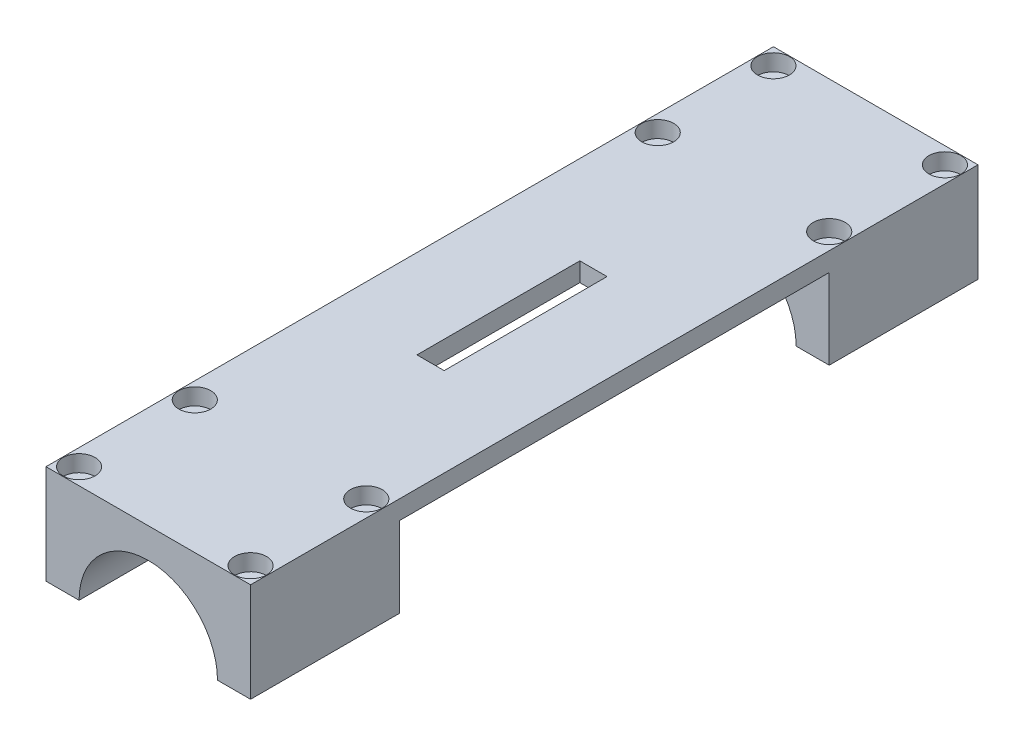
ISO-10303-21;
HEADER;
FILE_DESCRIPTION(('STEP AP214'),'2;1');
FILE_NAME('part.step','',(''),(''),'','','');
FILE_SCHEMA(('AUTOMOTIVE_DESIGN { 1 0 10303 214 1 1 1 1 }'));
ENDSEC;
DATA;
#1=APPLICATION_CONTEXT('core data for automotive mechanical design processes');
#2=APPLICATION_PROTOCOL_DEFINITION('international standard','automotive_design',2000,#1);
#3=PRODUCT_CONTEXT('',#1,'mechanical');
#4=PRODUCT('Part','Part','',(#3));
#5=PRODUCT_RELATED_PRODUCT_CATEGORY('part','',(#4));
#6=PRODUCT_DEFINITION_FORMATION('','',#4);
#7=PRODUCT_DEFINITION_CONTEXT('part definition',#1,'design');
#8=PRODUCT_DEFINITION('design','',#6,#7);
#9=PRODUCT_DEFINITION_SHAPE('','',#8);
#10=(LENGTH_UNIT() NAMED_UNIT(*) SI_UNIT(.MILLI.,.METRE.));
#11=(NAMED_UNIT(*) PLANE_ANGLE_UNIT() SI_UNIT($,.RADIAN.));
#12=(NAMED_UNIT(*) SI_UNIT($,.STERADIAN.) SOLID_ANGLE_UNIT());
#13=UNCERTAINTY_MEASURE_WITH_UNIT(LENGTH_MEASURE(1.E-05),#10,'distance_accuracy_value','');
#14=(GEOMETRIC_REPRESENTATION_CONTEXT(3) GLOBAL_UNCERTAINTY_ASSIGNED_CONTEXT((#13)) GLOBAL_UNIT_ASSIGNED_CONTEXT((#10,
#11,#12)) REPRESENTATION_CONTEXT('',''));
#15=CARTESIAN_POINT('',(0.,0.,0.));
#16=DIRECTION('',(0.,0.,1.));
#17=DIRECTION('',(1.,0.,0.));
#18=AXIS2_PLACEMENT_3D('',#15,#16,#17);
#19=CARTESIAN_POINT('',(15.5600623846513,0.,108.));
#20=DIRECTION('',(0.,1.,0.));
#21=DIRECTION('',(0.,0.,1.));
#22=AXIS2_PLACEMENT_3D('',#19,#20,#21);
#23=CYLINDRICAL_SURFACE('',#22,1.29999999999999);
#24=CARTESIAN_POINT('',(15.5600623846513,0.,108.));
#25=DIRECTION('',(0.,1.,0.));
#26=DIRECTION('',(0.,0.,1.));
#27=AXIS2_PLACEMENT_3D('',#24,#25,#26);
#28=CIRCLE('',#27,1.29999999999999);
#29=CARTESIAN_POINT('',(15.5600623846513,0.,109.3));
#30=VERTEX_POINT('',#29);
#31=EDGE_CURVE('E351',#30,#30,#28,.T.);
#32=ORIENTED_EDGE('',*,*,#31,.F.);
#33=EDGE_LOOP('',(#32));
#34=FACE_BOUND('',#33,.T.);
#35=CARTESIAN_POINT('',(15.5600623846513,15.,108.));
#36=DIRECTION('',(0.,1.,0.));
#37=DIRECTION('',(0.,0.,1.));
#38=AXIS2_PLACEMENT_3D('',#35,#36,#37);
#39=CIRCLE('',#38,1.29999999999999);
#40=CARTESIAN_POINT('',(15.5600623846513,15.,109.3));
#41=VERTEX_POINT('',#40);
#42=EDGE_CURVE('E307',#41,#41,#39,.F.);
#43=ORIENTED_EDGE('',*,*,#42,.F.);
#44=EDGE_LOOP('',(#43));
#45=FACE_BOUND('',#44,.T.);
#46=ADVANCED_FACE('F39',(#34,#45),#23,.F.);
#47=CARTESIAN_POINT('',(-15.5600623846513,0.,129.));
#48=DIRECTION('',(0.,1.,0.));
#49=DIRECTION('',(0.,0.,1.));
#50=AXIS2_PLACEMENT_3D('',#47,#48,#49);
#51=CYLINDRICAL_SURFACE('',#50,1.30000000000001);
#52=CARTESIAN_POINT('',(-15.5600623846513,0.,129.));
#53=DIRECTION('',(0.,1.,0.));
#54=DIRECTION('',(0.,0.,1.));
#55=AXIS2_PLACEMENT_3D('',#52,#53,#54);
#56=CIRCLE('',#55,1.30000000000001);
#57=CARTESIAN_POINT('',(-15.5600623846513,0.,130.3));
#58=VERTEX_POINT('',#57);
#59=EDGE_CURVE('E354',#58,#58,#56,.T.);
#60=ORIENTED_EDGE('',*,*,#59,.F.);
#61=EDGE_LOOP('',(#60));
#62=FACE_BOUND('',#61,.T.);
#63=CARTESIAN_POINT('',(-15.5600623846513,15.,129.));
#64=DIRECTION('',(0.,1.,0.));
#65=DIRECTION('',(0.,0.,1.));
#66=AXIS2_PLACEMENT_3D('',#63,#64,#65);
#67=CIRCLE('',#66,1.30000000000001);
#68=CARTESIAN_POINT('',(-15.5600623846513,15.,130.3));
#69=VERTEX_POINT('',#68);
#70=EDGE_CURVE('E303',#69,#69,#67,.F.);
#71=ORIENTED_EDGE('',*,*,#70,.F.);
#72=EDGE_LOOP('',(#71));
#73=FACE_BOUND('',#72,.T.);
#74=ADVANCED_FACE('F402',(#62,#73),#51,.F.);
#75=CARTESIAN_POINT('',(-15.5600623846513,0.,24.));
#76=DIRECTION('',(0.,1.,0.));
#77=DIRECTION('',(0.,0.,1.));
#78=AXIS2_PLACEMENT_3D('',#75,#76,#77);
#79=CYLINDRICAL_SURFACE('',#78,1.3);
#80=CARTESIAN_POINT('',(-15.5600623846513,0.,24.));
#81=DIRECTION('',(0.,1.,0.));
#82=DIRECTION('',(0.,0.,1.));
#83=AXIS2_PLACEMENT_3D('',#80,#81,#82);
#84=CIRCLE('',#83,1.3);
#85=CARTESIAN_POINT('',(-15.5600623846513,0.,25.3));
#86=VERTEX_POINT('',#85);
#87=EDGE_CURVE('E360',#86,#86,#84,.T.);
#88=ORIENTED_EDGE('',*,*,#87,.F.);
#89=EDGE_LOOP('',(#88));
#90=FACE_BOUND('',#89,.T.);
#91=CARTESIAN_POINT('',(-15.5600623846513,15.,24.));
#92=DIRECTION('',(0.,1.,0.));
#93=DIRECTION('',(0.,0.,1.));
#94=AXIS2_PLACEMENT_3D('',#91,#92,#93);
#95=CIRCLE('',#94,1.3);
#96=CARTESIAN_POINT('',(-15.5600623846513,15.,25.3));
#97=VERTEX_POINT('',#96);
#98=EDGE_CURVE('E293',#97,#97,#95,.F.);
#99=ORIENTED_EDGE('',*,*,#98,.F.);
#100=EDGE_LOOP('',(#99));
#101=FACE_BOUND('',#100,.T.);
#102=ADVANCED_FACE('F380',(#90,#101),#79,.F.);
#103=CARTESIAN_POINT('',(15.5600623846513,0.,3.));
#104=DIRECTION('',(0.,1.,0.));
#105=DIRECTION('',(0.,0.,1.));
#106=AXIS2_PLACEMENT_3D('',#103,#104,#105);
#107=CYLINDRICAL_SURFACE('',#106,1.3);
#108=CARTESIAN_POINT('',(15.5600623846513,0.,3.));
#109=DIRECTION('',(0.,1.,0.));
#110=DIRECTION('',(0.,0.,1.));
#111=AXIS2_PLACEMENT_3D('',#108,#109,#110);
#112=CIRCLE('',#111,1.3);
#113=CARTESIAN_POINT('',(15.5600623846513,0.,4.3));
#114=VERTEX_POINT('',#113);
#115=EDGE_CURVE('E369',#114,#114,#112,.T.);
#116=ORIENTED_EDGE('',*,*,#115,.F.);
#117=EDGE_LOOP('',(#116));
#118=FACE_BOUND('',#117,.T.);
#119=CARTESIAN_POINT('',(15.5600623846513,15.,3.));
#120=DIRECTION('',(0.,1.,0.));
#121=DIRECTION('',(0.,0.,1.));
#122=AXIS2_PLACEMENT_3D('',#119,#120,#121);
#123=CIRCLE('',#122,1.3);
#124=CARTESIAN_POINT('',(15.5600623846513,15.,4.3));
#125=VERTEX_POINT('',#124);
#126=EDGE_CURVE('E278',#125,#125,#123,.F.);
#127=ORIENTED_EDGE('',*,*,#126,.F.);
#128=EDGE_LOOP('',(#127));
#129=FACE_BOUND('',#128,.T.);
#130=ADVANCED_FACE('F376',(#118,#129),#107,.F.);
#131=CARTESIAN_POINT('',(0.,0.,132.));
#132=DIRECTION('',(0.,0.,-1.));
#133=DIRECTION('',(-1.,0.,0.));
#134=AXIS2_PLACEMENT_3D('',#131,#132,#133);
#135=CYLINDRICAL_SURFACE('',#134,12.5600623846513);
#136=DIRECTION('',(0.,0.,-1.));
#137=VECTOR('',#136,1.);
#138=CARTESIAN_POINT('',(12.5600623846513,0.,132.));
#139=LINE('',#138,#137);
#140=CARTESIAN_POINT('',(12.5600623846513,0.,27.));
#141=VERTEX_POINT('',#140);
#142=CARTESIAN_POINT('',(12.5600623846513,0.,0.));
#143=VERTEX_POINT('',#142);
#144=EDGE_CURVE('E272',#141,#143,#139,.T.);
#145=ORIENTED_EDGE('',*,*,#144,.F.);
#146=CARTESIAN_POINT('',(0.,0.,27.));
#147=DIRECTION('',(0.,0.,-1.));
#148=DIRECTION('',(-1.,0.,0.));
#149=AXIS2_PLACEMENT_3D('',#146,#147,#148);
#150=CIRCLE('',#149,12.5600623846513);
#151=CARTESIAN_POINT('',(-12.5600623846513,0.,27.));
#152=VERTEX_POINT('',#151);
#153=EDGE_CURVE('E218',#141,#152,#150,.F.);
#154=ORIENTED_EDGE('',*,*,#153,.T.);
#155=DIRECTION('',(0.,0.,-1.));
#156=VECTOR('',#155,1.);
#157=CARTESIAN_POINT('',(-12.5600623846513,0.,132.));
#158=LINE('',#157,#156);
#159=CARTESIAN_POINT('',(-12.5600623846513,0.,0.));
#160=VERTEX_POINT('',#159);
#161=EDGE_CURVE('E240',#152,#160,#158,.T.);
#162=ORIENTED_EDGE('',*,*,#161,.T.);
#163=CARTESIAN_POINT('',(0.,0.,0.));
#164=DIRECTION('',(0.,0.,-1.));
#165=DIRECTION('',(-1.,0.,0.));
#166=AXIS2_PLACEMENT_3D('',#163,#164,#165);
#167=CIRCLE('',#166,12.5600623846513);
#168=EDGE_CURVE('E225',#160,#143,#167,.T.);
#169=ORIENTED_EDGE('',*,*,#168,.T.);
#170=EDGE_LOOP('',(#145,#154,#162,#169));
#171=FACE_BOUND('',#170,.T.);
#172=ADVANCED_FACE('F379',(#171),#135,.F.);
#173=CARTESIAN_POINT('',(12.5600623846513,0.,132.));
#174=DIRECTION('',(0.,1.,0.));
#175=DIRECTION('',(-1.,0.,0.));
#176=AXIS2_PLACEMENT_3D('',#173,#174,#175);
#177=PLANE('',#176);
#178=CARTESIAN_POINT('',(15.5600623846513,0.,24.));
#179=DIRECTION('',(0.,1.,0.));
#180=DIRECTION('',(0.,0.,-1.));
#181=AXIS2_PLACEMENT_3D('',#178,#179,#180);
#182=CIRCLE('',#181,1.3);
#183=CARTESIAN_POINT('',(15.5600623846513,0.,22.7));
#184=VERTEX_POINT('',#183);
#185=EDGE_CURVE('E366',#184,#184,#182,.T.);
#186=ORIENTED_EDGE('',*,*,#185,.T.);
#187=EDGE_LOOP('',(#186));
#188=FACE_BOUND('',#187,.T.);
#189=ORIENTED_EDGE('',*,*,#115,.T.);
#190=EDGE_LOOP('',(#189));
#191=FACE_BOUND('',#190,.T.);
#192=DIRECTION('',(0.,0.,-1.));
#193=VECTOR('',#192,1.);
#194=CARTESIAN_POINT('',(18.5600623846513,0.,132.));
#195=LINE('',#194,#193);
#196=CARTESIAN_POINT('',(18.5600623846513,0.,27.));
#197=VERTEX_POINT('',#196);
#198=CARTESIAN_POINT('',(18.5600623846513,0.,0.));
#199=VERTEX_POINT('',#198);
#200=EDGE_CURVE('E268',#197,#199,#195,.T.);
#201=ORIENTED_EDGE('',*,*,#200,.F.);
#202=DIRECTION('',(-1.,0.,0.));
#203=VECTOR('',#202,1.);
#204=CARTESIAN_POINT('',(113.439937615349,0.,27.));
#205=LINE('',#204,#203);
#206=EDGE_CURVE('E200',#197,#141,#205,.T.);
#207=ORIENTED_EDGE('',*,*,#206,.T.);
#208=ORIENTED_EDGE('',*,*,#144,.T.);
#209=DIRECTION('',(1.,0.,0.));
#210=VECTOR('',#209,1.);
#211=CARTESIAN_POINT('',(12.5600623846513,0.,0.));
#212=LINE('',#211,#210);
#213=EDGE_CURVE('E243',#143,#199,#212,.T.);
#214=ORIENTED_EDGE('',*,*,#213,.T.);
#215=EDGE_LOOP('',(#201,#207,#208,#214));
#216=FACE_BOUND('',#215,.T.);
#217=ADVANCED_FACE('F373',(#188,#191,#216),#177,.F.);
#218=CARTESIAN_POINT('',(-12.5600623846513,0.,132.));
#219=DIRECTION('',(0.,1.,0.));
#220=DIRECTION('',(-1.,0.,0.));
#221=AXIS2_PLACEMENT_3D('',#218,#219,#220);
#222=PLANE('',#221);
#223=ORIENTED_EDGE('',*,*,#87,.T.);
#224=EDGE_LOOP('',(#223));
#225=FACE_BOUND('',#224,.T.);
#226=CARTESIAN_POINT('',(-15.5600623846513,0.,3.));
#227=DIRECTION('',(0.,1.,0.));
#228=DIRECTION('',(0.,0.,-1.));
#229=AXIS2_PLACEMENT_3D('',#226,#227,#228);
#230=CIRCLE('',#229,1.3);
#231=CARTESIAN_POINT('',(-15.5600623846513,0.,1.7));
#232=VERTEX_POINT('',#231);
#233=EDGE_CURVE('E363',#232,#232,#230,.T.);
#234=ORIENTED_EDGE('',*,*,#233,.T.);
#235=EDGE_LOOP('',(#234));
#236=FACE_BOUND('',#235,.T.);
#237=ORIENTED_EDGE('',*,*,#161,.F.);
#238=DIRECTION('',(-1.,0.,0.));
#239=VECTOR('',#238,1.);
#240=CARTESIAN_POINT('',(-12.5600623846513,0.,27.));
#241=LINE('',#240,#239);
#242=CARTESIAN_POINT('',(-18.5600623846513,0.,27.));
#243=VERTEX_POINT('',#242);
#244=EDGE_CURVE('E11',#152,#243,#241,.T.);
#245=ORIENTED_EDGE('',*,*,#244,.T.);
#246=DIRECTION('',(0.,0.,-1.));
#247=VECTOR('',#246,1.);
#248=CARTESIAN_POINT('',(-18.5600623846513,0.,132.));
#249=LINE('',#248,#247);
#250=CARTESIAN_POINT('',(-18.5600623846513,0.,0.));
#251=VERTEX_POINT('',#250);
#252=EDGE_CURVE('E258',#243,#251,#249,.T.);
#253=ORIENTED_EDGE('',*,*,#252,.T.);
#254=DIRECTION('',(1.,0.,0.));
#255=VECTOR('',#254,1.);
#256=CARTESIAN_POINT('',(-12.5600623846513,0.,0.));
#257=LINE('',#256,#255);
#258=EDGE_CURVE('E230',#251,#160,#257,.T.);
#259=ORIENTED_EDGE('',*,*,#258,.T.);
#260=EDGE_LOOP('',(#237,#245,#253,#259));
#261=FACE_BOUND('',#260,.T.);
#262=ADVANCED_FACE('F461',(#225,#236,#261),#222,.F.);
#263=CARTESIAN_POINT('',(-12.5600623846513,0.,132.));
#264=VERTEX_POINT('',#263);
#265=CARTESIAN_POINT('',(-12.5600623846513,0.,105.));
#266=VERTEX_POINT('',#265);
#267=EDGE_CURVE('E255',#264,#266,#158,.T.);
#268=ORIENTED_EDGE('',*,*,#267,.T.);
#269=CARTESIAN_POINT('',(0.,0.,105.));
#270=DIRECTION('',(0.,0.,1.));
#271=DIRECTION('',(1.,0.,0.));
#272=AXIS2_PLACEMENT_3D('',#269,#270,#271);
#273=CIRCLE('',#272,12.5600623846513);
#274=CARTESIAN_POINT('',(12.5600623846513,0.,105.));
#275=VERTEX_POINT('',#274);
#276=EDGE_CURVE('E212',#266,#275,#273,.F.);
#277=ORIENTED_EDGE('',*,*,#276,.T.);
#278=CARTESIAN_POINT('',(12.5600623846513,0.,132.));
#279=VERTEX_POINT('',#278);
#280=EDGE_CURVE('E273',#279,#275,#139,.T.);
#281=ORIENTED_EDGE('',*,*,#280,.F.);
#282=CARTESIAN_POINT('',(0.,0.,132.));
#283=DIRECTION('',(0.,0.,-1.));
#284=DIRECTION('',(-1.,0.,0.));
#285=AXIS2_PLACEMENT_3D('',#282,#283,#284);
#286=CIRCLE('',#285,12.5600623846513);
#287=EDGE_CURVE('E226',#264,#279,#286,.T.);
#288=ORIENTED_EDGE('',*,*,#287,.F.);
#289=EDGE_LOOP('',(#268,#277,#281,#288));
#290=FACE_BOUND('',#289,.T.);
#291=ADVANCED_FACE('F41',(#290),#135,.F.);
#292=CARTESIAN_POINT('',(15.5600623846513,0.,129.));
#293=DIRECTION('',(0.,1.,0.));
#294=DIRECTION('',(0.,0.,-1.));
#295=AXIS2_PLACEMENT_3D('',#292,#293,#294);
#296=CIRCLE('',#295,1.3);
#297=CARTESIAN_POINT('',(15.5600623846513,0.,127.7));
#298=VERTEX_POINT('',#297);
#299=EDGE_CURVE('E281',#298,#298,#296,.T.);
#300=ORIENTED_EDGE('',*,*,#299,.T.);
#301=EDGE_LOOP('',(#300));
#302=FACE_BOUND('',#301,.T.);
#303=ORIENTED_EDGE('',*,*,#31,.T.);
#304=EDGE_LOOP('',(#303));
#305=FACE_BOUND('',#304,.T.);
#306=ORIENTED_EDGE('',*,*,#280,.T.);
#307=DIRECTION('',(-1.,0.,0.));
#308=VECTOR('',#307,1.);
#309=CARTESIAN_POINT('',(113.439937615349,0.,105.));
#310=LINE('',#309,#308);
#311=CARTESIAN_POINT('',(18.5600623846513,0.,105.));
#312=VERTEX_POINT('',#311);
#313=EDGE_CURVE('E199',#312,#275,#310,.T.);
#314=ORIENTED_EDGE('',*,*,#313,.F.);
#315=CARTESIAN_POINT('',(18.5600623846513,0.,132.));
#316=VERTEX_POINT('',#315);
#317=EDGE_CURVE('E269',#316,#312,#195,.T.);
#318=ORIENTED_EDGE('',*,*,#317,.F.);
#319=DIRECTION('',(1.,0.,0.));
#320=VECTOR('',#319,1.);
#321=CARTESIAN_POINT('',(12.5600623846513,0.,132.));
#322=LINE('',#321,#320);
#323=EDGE_CURVE('E229',#279,#316,#322,.T.);
#324=ORIENTED_EDGE('',*,*,#323,.F.);
#325=EDGE_LOOP('',(#306,#314,#318,#324));
#326=FACE_BOUND('',#325,.T.);
#327=ADVANCED_FACE('F471',(#302,#305,#326),#177,.F.);
#328=CARTESIAN_POINT('',(18.5600623846513,0.,132.));
#329=DIRECTION('',(-1.,0.,0.));
#330=DIRECTION('',(0.,0.,1.));
#331=AXIS2_PLACEMENT_3D('',#328,#329,#330);
#332=PLANE('',#331);
#333=DIRECTION('',(0.,0.,-1.));
#334=VECTOR('',#333,1.);
#335=CARTESIAN_POINT('',(18.5600623846513,14.57,132.));
#336=LINE('',#335,#334);
#337=CARTESIAN_POINT('',(18.5600623846513,14.57,105.));
#338=VERTEX_POINT('',#337);
#339=CARTESIAN_POINT('',(18.5600623846513,14.57,27.));
#340=VERTEX_POINT('',#339);
#341=EDGE_CURVE('E222',#338,#340,#336,.T.);
#342=ORIENTED_EDGE('',*,*,#341,.T.);
#343=DIRECTION('',(0.,-1.,0.));
#344=VECTOR('',#343,1.);
#345=CARTESIAN_POINT('',(18.5600623846513,0.,27.));
#346=LINE('',#345,#344);
#347=EDGE_CURVE('E215',#340,#197,#346,.T.);
#348=ORIENTED_EDGE('',*,*,#347,.T.);
#349=ORIENTED_EDGE('',*,*,#200,.T.);
#350=DIRECTION('',(0.,1.,0.));
#351=VECTOR('',#350,1.);
#352=CARTESIAN_POINT('',(18.5600623846513,0.,0.));
#353=LINE('',#352,#351);
#354=CARTESIAN_POINT('',(18.5600623846513,18.,0.));
#355=VERTEX_POINT('',#354);
#356=EDGE_CURVE('E246',#199,#355,#353,.T.);
#357=ORIENTED_EDGE('',*,*,#356,.T.);
#358=DIRECTION('',(0.,0.,-1.));
#359=VECTOR('',#358,1.);
#360=CARTESIAN_POINT('',(18.5600623846513,18.,132.));
#361=LINE('',#360,#359);
#362=CARTESIAN_POINT('',(18.5600623846513,18.,132.));
#363=VERTEX_POINT('',#362);
#364=EDGE_CURVE('E265',#363,#355,#361,.T.);
#365=ORIENTED_EDGE('',*,*,#364,.F.);
#366=DIRECTION('',(0.,1.,0.));
#367=VECTOR('',#366,1.);
#368=CARTESIAN_POINT('',(18.5600623846513,0.,132.));
#369=LINE('',#368,#367);
#370=EDGE_CURVE('E232',#316,#363,#369,.T.);
#371=ORIENTED_EDGE('',*,*,#370,.F.);
#372=ORIENTED_EDGE('',*,*,#317,.T.);
#373=DIRECTION('',(0.,1.,0.));
#374=VECTOR('',#373,1.);
#375=CARTESIAN_POINT('',(18.5600623846513,0.,105.));
#376=LINE('',#375,#374);
#377=EDGE_CURVE('E203',#312,#338,#376,.T.);
#378=ORIENTED_EDGE('',*,*,#377,.T.);
#379=EDGE_LOOP('',(#342,#348,#349,#357,#365,#371,#372,#378));
#380=FACE_BOUND('',#379,.T.);
#381=ADVANCED_FACE('F468',(#380),#332,.F.);
#382=CARTESIAN_POINT('',(-18.5600623846513,18.,132.));
#383=DIRECTION('',(0.,-1.,0.));
#384=DIRECTION('',(0.,0.,-1.));
#385=AXIS2_PLACEMENT_3D('',#382,#383,#384);
#386=PLANE('',#385);
#387=CARTESIAN_POINT('',(15.5600623846513,18.,129.));
#388=DIRECTION('',(0.,1.,0.));
#389=DIRECTION('',(0.,0.,-1.));
#390=AXIS2_PLACEMENT_3D('',#387,#388,#389);
#391=CIRCLE('',#390,2.9);
#392=CARTESIAN_POINT('',(15.5600623846513,18.,126.1));
#393=VERTEX_POINT('',#392);
#394=EDGE_CURVE('E323',#393,#393,#391,.T.);
#395=ORIENTED_EDGE('',*,*,#394,.F.);
#396=EDGE_LOOP('',(#395));
#397=FACE_BOUND('',#396,.T.);
#398=CARTESIAN_POINT('',(15.5600623846513,18.,108.));
#399=DIRECTION('',(0.,1.,0.));
#400=DIRECTION('',(0.,0.,1.));
#401=AXIS2_PLACEMENT_3D('',#398,#399,#400);
#402=CIRCLE('',#401,2.9);
#403=CARTESIAN_POINT('',(15.5600623846513,18.,110.9));
#404=VERTEX_POINT('',#403);
#405=EDGE_CURVE('E316',#404,#404,#402,.T.);
#406=ORIENTED_EDGE('',*,*,#405,.F.);
#407=EDGE_LOOP('',(#406));
#408=FACE_BOUND('',#407,.T.);
#409=CARTESIAN_POINT('',(-15.5600623846513,18.,129.));
#410=DIRECTION('',(0.,1.,0.));
#411=DIRECTION('',(0.,0.,1.));
#412=AXIS2_PLACEMENT_3D('',#409,#410,#411);
#413=CIRCLE('',#412,2.9);
#414=CARTESIAN_POINT('',(-15.5600623846513,18.,131.9));
#415=VERTEX_POINT('',#414);
#416=EDGE_CURVE('E309',#415,#415,#413,.T.);
#417=ORIENTED_EDGE('',*,*,#416,.F.);
#418=EDGE_LOOP('',(#417));
#419=FACE_BOUND('',#418,.T.);
#420=CARTESIAN_POINT('',(-15.5600623846513,18.,108.));
#421=DIRECTION('',(0.,1.,0.));
#422=DIRECTION('',(0.,0.,-1.));
#423=AXIS2_PLACEMENT_3D('',#420,#421,#422);
#424=CIRCLE('',#423,2.9);
#425=CARTESIAN_POINT('',(-15.5600623846513,18.,105.1));
#426=VERTEX_POINT('',#425);
#427=EDGE_CURVE('E305',#426,#426,#424,.T.);
#428=ORIENTED_EDGE('',*,*,#427,.F.);
#429=EDGE_LOOP('',(#428));
#430=FACE_BOUND('',#429,.T.);
#431=CARTESIAN_POINT('',(-15.5600623846513,18.,24.));
#432=DIRECTION('',(0.,1.,0.));
#433=DIRECTION('',(0.,0.,1.));
#434=AXIS2_PLACEMENT_3D('',#431,#432,#433);
#435=CIRCLE('',#434,2.9);
#436=CARTESIAN_POINT('',(-15.5600623846513,18.,26.9));
#437=VERTEX_POINT('',#436);
#438=EDGE_CURVE('E301',#437,#437,#435,.T.);
#439=ORIENTED_EDGE('',*,*,#438,.F.);
#440=EDGE_LOOP('',(#439));
#441=FACE_BOUND('',#440,.T.);
#442=CARTESIAN_POINT('',(-15.5600623846513,18.,3.00000000000001));
#443=DIRECTION('',(0.,1.,0.));
#444=DIRECTION('',(0.,0.,-1.));
#445=AXIS2_PLACEMENT_3D('',#442,#443,#444);
#446=CIRCLE('',#445,2.9);
#447=CARTESIAN_POINT('',(-15.5600623846513,18.,0.100000000000006));
#448=VERTEX_POINT('',#447);
#449=EDGE_CURVE('E296',#448,#448,#446,.T.);
#450=ORIENTED_EDGE('',*,*,#449,.F.);
#451=EDGE_LOOP('',(#450));
#452=FACE_BOUND('',#451,.T.);
#453=CARTESIAN_POINT('',(15.5600623846513,18.,24.));
#454=DIRECTION('',(0.,1.,0.));
#455=DIRECTION('',(0.,0.,-1.));
#456=AXIS2_PLACEMENT_3D('',#453,#454,#455);
#457=CIRCLE('',#456,2.9);
#458=CARTESIAN_POINT('',(15.5600623846513,18.,21.1));
#459=VERTEX_POINT('',#458);
#460=EDGE_CURVE('E291',#459,#459,#457,.T.);
#461=ORIENTED_EDGE('',*,*,#460,.F.);
#462=EDGE_LOOP('',(#461));
#463=FACE_BOUND('',#462,.T.);
#464=CARTESIAN_POINT('',(15.5600623846513,18.,3.));
#465=DIRECTION('',(0.,1.,0.));
#466=DIRECTION('',(0.,0.,1.));
#467=AXIS2_PLACEMENT_3D('',#464,#465,#466);
#468=CIRCLE('',#467,2.9);
#469=CARTESIAN_POINT('',(15.5600623846513,18.,5.9));
#470=VERTEX_POINT('',#469);
#471=EDGE_CURVE('E286',#470,#470,#468,.T.);
#472=ORIENTED_EDGE('',*,*,#471,.F.);
#473=EDGE_LOOP('',(#472));
#474=FACE_BOUND('',#473,.T.);
#475=DIRECTION('',(-1.,0.,0.));
#476=VECTOR('',#475,1.);
#477=CARTESIAN_POINT('',(-18.5600623846513,18.,80.778146300668));
#478=LINE('',#477,#476);
#479=CARTESIAN_POINT('',(2.47006065999988,18.,80.778146300668));
#480=VERTEX_POINT('',#479);
#481=CARTESIAN_POINT('',(-2.47006065999988,18.,80.778146300668));
#482=VERTEX_POINT('',#481);
#483=EDGE_CURVE('E185',#480,#482,#478,.T.);
#484=ORIENTED_EDGE('',*,*,#483,.T.);
#485=DIRECTION('',(0.,0.,-1.));
#486=VECTOR('',#485,1.);
#487=CARTESIAN_POINT('',(-2.47006065999988,18.,132.));
#488=LINE('',#487,#486);
#489=CARTESIAN_POINT('',(-2.47006065999988,18.,51.221853699332));
#490=VERTEX_POINT('',#489);
#491=EDGE_CURVE('E188',#482,#490,#488,.T.);
#492=ORIENTED_EDGE('',*,*,#491,.T.);
#493=DIRECTION('',(1.,0.,0.));
#494=VECTOR('',#493,1.);
#495=CARTESIAN_POINT('',(-18.5600623846513,18.,51.221853699332));
#496=LINE('',#495,#494);
#497=CARTESIAN_POINT('',(2.47006065999988,18.,51.221853699332));
#498=VERTEX_POINT('',#497);
#499=EDGE_CURVE('E180',#490,#498,#496,.T.);
#500=ORIENTED_EDGE('',*,*,#499,.T.);
#501=DIRECTION('',(0.,0.,1.));
#502=VECTOR('',#501,1.);
#503=CARTESIAN_POINT('',(2.47006065999988,18.,132.));
#504=LINE('',#503,#502);
#505=EDGE_CURVE('E160',#498,#480,#504,.T.);
#506=ORIENTED_EDGE('',*,*,#505,.T.);
#507=EDGE_LOOP('',(#484,#492,#500,#506));
#508=FACE_BOUND('',#507,.T.);
#509=DIRECTION('',(-1.,0.,0.));
#510=VECTOR('',#509,1.);
#511=CARTESIAN_POINT('',(-18.5600623846513,18.,0.));
#512=LINE('',#511,#510);
#513=CARTESIAN_POINT('',(-18.5600623846513,18.,0.));
#514=VERTEX_POINT('',#513);
#515=EDGE_CURVE('E248',#355,#514,#512,.T.);
#516=ORIENTED_EDGE('',*,*,#515,.T.);
#517=DIRECTION('',(0.,0.,-1.));
#518=VECTOR('',#517,1.);
#519=CARTESIAN_POINT('',(-18.5600623846513,18.,132.));
#520=LINE('',#519,#518);
#521=CARTESIAN_POINT('',(-18.5600623846513,18.,132.));
#522=VERTEX_POINT('',#521);
#523=EDGE_CURVE('E262',#522,#514,#520,.T.);
#524=ORIENTED_EDGE('',*,*,#523,.F.);
#525=DIRECTION('',(-1.,0.,0.));
#526=VECTOR('',#525,1.);
#527=CARTESIAN_POINT('',(-18.5600623846513,18.,132.));
#528=LINE('',#527,#526);
#529=EDGE_CURVE('E234',#363,#522,#528,.T.);
#530=ORIENTED_EDGE('',*,*,#529,.F.);
#531=ORIENTED_EDGE('',*,*,#364,.T.);
#532=EDGE_LOOP('',(#516,#524,#530,#531));
#533=FACE_BOUND('',#532,.T.);
#534=ADVANCED_FACE('F464',(#397,#408,#419,#430,#441,#452,#463,#474,#508,#533),#386,.F.);
#535=CARTESIAN_POINT('',(-18.5600623846513,0.,132.));
#536=DIRECTION('',(1.,0.,0.));
#537=DIRECTION('',(0.,0.,-1.));
#538=AXIS2_PLACEMENT_3D('',#535,#536,#537);
#539=PLANE('',#538);
#540=ORIENTED_EDGE('',*,*,#252,.F.);
#541=DIRECTION('',(0.,-1.,0.));
#542=VECTOR('',#541,1.);
#543=CARTESIAN_POINT('',(-18.5600623846513,0.,27.));
#544=LINE('',#543,#542);
#545=CARTESIAN_POINT('',(-18.5600623846513,14.57,27.));
#546=VERTEX_POINT('',#545);
#547=EDGE_CURVE('E197',#546,#243,#544,.T.);
#548=ORIENTED_EDGE('',*,*,#547,.F.);
#549=DIRECTION('',(0.,0.,-1.));
#550=VECTOR('',#549,1.);
#551=CARTESIAN_POINT('',(-18.5600623846513,14.57,105.));
#552=LINE('',#551,#550);
#553=CARTESIAN_POINT('',(-18.5600623846513,14.57,105.));
#554=VERTEX_POINT('',#553);
#555=EDGE_CURVE('E194',#554,#546,#552,.T.);
#556=ORIENTED_EDGE('',*,*,#555,.F.);
#557=DIRECTION('',(0.,1.,0.));
#558=VECTOR('',#557,1.);
#559=CARTESIAN_POINT('',(-18.5600623846513,0.,105.));
#560=LINE('',#559,#558);
#561=CARTESIAN_POINT('',(-18.5600623846513,0.,105.));
#562=VERTEX_POINT('',#561);
#563=EDGE_CURVE('E191',#562,#554,#560,.T.);
#564=ORIENTED_EDGE('',*,*,#563,.F.);
#565=CARTESIAN_POINT('',(-18.5600623846513,0.,132.));
#566=VERTEX_POINT('',#565);
#567=EDGE_CURVE('E259',#566,#562,#249,.T.);
#568=ORIENTED_EDGE('',*,*,#567,.F.);
#569=DIRECTION('',(0.,-1.,0.));
#570=VECTOR('',#569,1.);
#571=CARTESIAN_POINT('',(-18.5600623846513,0.,132.));
#572=LINE('',#571,#570);
#573=EDGE_CURVE('E236',#522,#566,#572,.T.);
#574=ORIENTED_EDGE('',*,*,#573,.F.);
#575=ORIENTED_EDGE('',*,*,#523,.T.);
#576=DIRECTION('',(0.,-1.,0.));
#577=VECTOR('',#576,1.);
#578=CARTESIAN_POINT('',(-18.5600623846513,0.,0.));
#579=LINE('',#578,#577);
#580=EDGE_CURVE('E250',#514,#251,#579,.T.);
#581=ORIENTED_EDGE('',*,*,#580,.T.);
#582=EDGE_LOOP('',(#540,#548,#556,#564,#568,#574,#575,#581));
#583=FACE_BOUND('',#582,.T.);
#584=ADVANCED_FACE('F459',(#583),#539,.F.);
#585=ORIENTED_EDGE('',*,*,#59,.T.);
#586=EDGE_LOOP('',(#585));
#587=FACE_BOUND('',#586,.T.);
#588=CARTESIAN_POINT('',(-15.5600623846513,0.,108.));
#589=DIRECTION('',(0.,1.,0.));
#590=DIRECTION('',(0.,0.,-1.));
#591=AXIS2_PLACEMENT_3D('',#588,#589,#590);
#592=CIRCLE('',#591,1.3);
#593=CARTESIAN_POINT('',(-15.5600623846513,0.,106.7));
#594=VERTEX_POINT('',#593);
#595=EDGE_CURVE('E357',#594,#594,#592,.T.);
#596=ORIENTED_EDGE('',*,*,#595,.T.);
#597=EDGE_LOOP('',(#596));
#598=FACE_BOUND('',#597,.T.);
#599=ORIENTED_EDGE('',*,*,#567,.T.);
#600=DIRECTION('',(1.,0.,0.));
#601=VECTOR('',#600,1.);
#602=CARTESIAN_POINT('',(-12.5600623846513,0.,105.));
#603=LINE('',#602,#601);
#604=EDGE_CURVE('E48',#562,#266,#603,.T.);
#605=ORIENTED_EDGE('',*,*,#604,.T.);
#606=ORIENTED_EDGE('',*,*,#267,.F.);
#607=DIRECTION('',(1.,0.,0.));
#608=VECTOR('',#607,1.);
#609=CARTESIAN_POINT('',(-12.5600623846513,0.,132.));
#610=LINE('',#609,#608);
#611=EDGE_CURVE('E238',#566,#264,#610,.T.);
#612=ORIENTED_EDGE('',*,*,#611,.F.);
#613=EDGE_LOOP('',(#599,#605,#606,#612));
#614=FACE_BOUND('',#613,.T.);
#615=ADVANCED_FACE('F452',(#587,#598,#614),#222,.F.);
#616=CARTESIAN_POINT('',(0.,0.,132.));
#617=DIRECTION('',(0.,0.,-1.));
#618=DIRECTION('',(-1.,0.,0.));
#619=AXIS2_PLACEMENT_3D('',#616,#617,#618);
#620=PLANE('',#619);
#621=ORIENTED_EDGE('',*,*,#287,.T.);
#622=ORIENTED_EDGE('',*,*,#323,.T.);
#623=ORIENTED_EDGE('',*,*,#370,.T.);
#624=ORIENTED_EDGE('',*,*,#529,.T.);
#625=ORIENTED_EDGE('',*,*,#573,.T.);
#626=ORIENTED_EDGE('',*,*,#611,.T.);
#627=EDGE_LOOP('',(#621,#622,#623,#624,#625,#626));
#628=FACE_BOUND('',#627,.T.);
#629=ADVANCED_FACE('F449',(#628),#620,.F.);
#630=CARTESIAN_POINT('',(0.,0.,0.));
#631=DIRECTION('',(0.,0.,-1.));
#632=DIRECTION('',(-1.,0.,0.));
#633=AXIS2_PLACEMENT_3D('',#630,#631,#632);
#634=PLANE('',#633);
#635=ORIENTED_EDGE('',*,*,#168,.F.);
#636=ORIENTED_EDGE('',*,*,#258,.F.);
#637=ORIENTED_EDGE('',*,*,#580,.F.);
#638=ORIENTED_EDGE('',*,*,#515,.F.);
#639=ORIENTED_EDGE('',*,*,#356,.F.);
#640=ORIENTED_EDGE('',*,*,#213,.F.);
#641=EDGE_LOOP('',(#635,#636,#637,#638,#639,#640));
#642=FACE_BOUND('',#641,.T.);
#643=ADVANCED_FACE('F445',(#642),#634,.T.);
#644=CARTESIAN_POINT('',(113.439937615349,14.57,105.));
#645=DIRECTION('',(0.,1.,0.));
#646=DIRECTION('',(0.,0.,1.));
#647=AXIS2_PLACEMENT_3D('',#644,#645,#646);
#648=PLANE('',#647);
#649=DIRECTION('',(1.,0.,0.));
#650=VECTOR('',#649,1.);
#651=CARTESIAN_POINT('',(2.47006065999988,14.57,51.221853699332));
#652=LINE('',#651,#650);
#653=CARTESIAN_POINT('',(-2.47006065999988,14.57,51.221853699332));
#654=VERTEX_POINT('',#653);
#655=CARTESIAN_POINT('',(2.47006065999988,14.57,51.221853699332));
#656=VERTEX_POINT('',#655);
#657=EDGE_CURVE('E166',#654,#656,#652,.T.);
#658=ORIENTED_EDGE('',*,*,#657,.F.);
#659=DIRECTION('',(0.,0.,-1.));
#660=VECTOR('',#659,1.);
#661=CARTESIAN_POINT('',(-2.47006065999988,14.57,51.221853699332));
#662=LINE('',#661,#660);
#663=CARTESIAN_POINT('',(-2.47006065999988,14.57,80.778146300668));
#664=VERTEX_POINT('',#663);
#665=EDGE_CURVE('E64',#664,#654,#662,.T.);
#666=ORIENTED_EDGE('',*,*,#665,.F.);
#667=DIRECTION('',(-1.,0.,0.));
#668=VECTOR('',#667,1.);
#669=CARTESIAN_POINT('',(2.47006065999988,14.57,80.778146300668));
#670=LINE('',#669,#668);
#671=CARTESIAN_POINT('',(2.47006065999988,14.57,80.778146300668));
#672=VERTEX_POINT('',#671);
#673=EDGE_CURVE('E173',#672,#664,#670,.T.);
#674=ORIENTED_EDGE('',*,*,#673,.F.);
#675=DIRECTION('',(0.,0.,1.));
#676=VECTOR('',#675,1.);
#677=CARTESIAN_POINT('',(2.47006065999988,14.57,51.221853699332));
#678=LINE('',#677,#676);
#679=EDGE_CURVE('E157',#656,#672,#678,.T.);
#680=ORIENTED_EDGE('',*,*,#679,.F.);
#681=EDGE_LOOP('',(#658,#666,#674,#680));
#682=FACE_BOUND('',#681,.T.);
#683=DIRECTION('',(-1.,0.,0.));
#684=VECTOR('',#683,1.);
#685=CARTESIAN_POINT('',(113.439937615349,14.57,105.));
#686=LINE('',#685,#684);
#687=EDGE_CURVE('E207',#338,#554,#686,.T.);
#688=ORIENTED_EDGE('',*,*,#687,.T.);
#689=ORIENTED_EDGE('',*,*,#555,.T.);
#690=DIRECTION('',(-1.,0.,0.));
#691=VECTOR('',#690,1.);
#692=CARTESIAN_POINT('',(113.439937615349,14.57,27.));
#693=LINE('',#692,#691);
#694=EDGE_CURVE('E204',#340,#546,#693,.T.);
#695=ORIENTED_EDGE('',*,*,#694,.F.);
#696=ORIENTED_EDGE('',*,*,#341,.F.);
#697=EDGE_LOOP('',(#688,#689,#695,#696));
#698=FACE_BOUND('',#697,.T.);
#699=ADVANCED_FACE('F170',(#682,#698),#648,.F.);
#700=CARTESIAN_POINT('',(113.439937615349,0.,27.));
#701=DIRECTION('',(0.,0.,-1.));
#702=DIRECTION('',(-1.,0.,0.));
#703=AXIS2_PLACEMENT_3D('',#700,#701,#702);
#704=PLANE('',#703);
#705=ORIENTED_EDGE('',*,*,#206,.F.);
#706=ORIENTED_EDGE('',*,*,#347,.F.);
#707=ORIENTED_EDGE('',*,*,#694,.T.);
#708=ORIENTED_EDGE('',*,*,#547,.T.);
#709=ORIENTED_EDGE('',*,*,#244,.F.);
#710=ORIENTED_EDGE('',*,*,#153,.F.);
#711=EDGE_LOOP('',(#705,#706,#707,#708,#709,#710));
#712=FACE_BOUND('',#711,.T.);
#713=ADVANCED_FACE('F439',(#712),#704,.F.);
#714=CARTESIAN_POINT('',(113.439937615349,0.,105.));
#715=DIRECTION('',(0.,0.,1.));
#716=DIRECTION('',(1.,0.,0.));
#717=AXIS2_PLACEMENT_3D('',#714,#715,#716);
#718=PLANE('',#717);
#719=ORIENTED_EDGE('',*,*,#604,.F.);
#720=ORIENTED_EDGE('',*,*,#563,.T.);
#721=ORIENTED_EDGE('',*,*,#687,.F.);
#722=ORIENTED_EDGE('',*,*,#377,.F.);
#723=ORIENTED_EDGE('',*,*,#313,.T.);
#724=ORIENTED_EDGE('',*,*,#276,.F.);
#725=EDGE_LOOP('',(#719,#720,#721,#722,#723,#724));
#726=FACE_BOUND('',#725,.T.);
#727=ADVANCED_FACE('F438',(#726),#718,.F.);
#728=CARTESIAN_POINT('',(-2.47006065999988,18.57,51.221853699332));
#729=DIRECTION('',(-1.,0.,0.));
#730=DIRECTION('',(0.,0.,1.));
#731=AXIS2_PLACEMENT_3D('',#728,#729,#730);
#732=PLANE('',#731);
#733=DIRECTION('',(0.,-1.,0.));
#734=VECTOR('',#733,1.);
#735=CARTESIAN_POINT('',(-2.47006065999988,18.57,80.778146300668));
#736=LINE('',#735,#734);
#737=EDGE_CURVE('E178',#482,#664,#736,.T.);
#738=ORIENTED_EDGE('',*,*,#737,.T.);
#739=ORIENTED_EDGE('',*,*,#665,.T.);
#740=DIRECTION('',(0.,-1.,0.));
#741=VECTOR('',#740,1.);
#742=CARTESIAN_POINT('',(-2.47006065999988,18.57,51.221853699332));
#743=LINE('',#742,#741);
#744=EDGE_CURVE('E163',#490,#654,#743,.T.);
#745=ORIENTED_EDGE('',*,*,#744,.F.);
#746=ORIENTED_EDGE('',*,*,#491,.F.);
#747=EDGE_LOOP('',(#738,#739,#745,#746));
#748=FACE_BOUND('',#747,.T.);
#749=ADVANCED_FACE('F431',(#748),#732,.F.);
#750=CARTESIAN_POINT('',(2.47006065999988,18.57,80.778146300668));
#751=DIRECTION('',(0.,0.,1.));
#752=DIRECTION('',(0.,-1.,0.));
#753=AXIS2_PLACEMENT_3D('',#750,#751,#752);
#754=PLANE('',#753);
#755=DIRECTION('',(0.,-1.,0.));
#756=VECTOR('',#755,1.);
#757=CARTESIAN_POINT('',(2.47006065999988,18.57,80.778146300668));
#758=LINE('',#757,#756);
#759=EDGE_CURVE('E162',#480,#672,#758,.T.);
#760=ORIENTED_EDGE('',*,*,#759,.T.);
#761=ORIENTED_EDGE('',*,*,#673,.T.);
#762=ORIENTED_EDGE('',*,*,#737,.F.);
#763=ORIENTED_EDGE('',*,*,#483,.F.);
#764=EDGE_LOOP('',(#760,#761,#762,#763));
#765=FACE_BOUND('',#764,.T.);
#766=ADVANCED_FACE('F428',(#765),#754,.F.);
#767=CARTESIAN_POINT('',(2.47006065999988,18.57,51.221853699332));
#768=DIRECTION('',(1.,0.,0.));
#769=DIRECTION('',(0.,0.,-1.));
#770=AXIS2_PLACEMENT_3D('',#767,#768,#769);
#771=PLANE('',#770);
#772=DIRECTION('',(0.,-1.,0.));
#773=VECTOR('',#772,1.);
#774=CARTESIAN_POINT('',(2.47006065999988,18.57,51.221853699332));
#775=LINE('',#774,#773);
#776=EDGE_CURVE('E56',#498,#656,#775,.T.);
#777=ORIENTED_EDGE('',*,*,#776,.T.);
#778=ORIENTED_EDGE('',*,*,#679,.T.);
#779=ORIENTED_EDGE('',*,*,#759,.F.);
#780=ORIENTED_EDGE('',*,*,#505,.F.);
#781=EDGE_LOOP('',(#777,#778,#779,#780));
#782=FACE_BOUND('',#781,.T.);
#783=ADVANCED_FACE('F154',(#782),#771,.F.);
#784=CARTESIAN_POINT('',(2.47006065999988,18.57,51.221853699332));
#785=DIRECTION('',(0.,0.,-1.));
#786=DIRECTION('',(0.,1.,0.));
#787=AXIS2_PLACEMENT_3D('',#784,#785,#786);
#788=PLANE('',#787);
#789=ORIENTED_EDGE('',*,*,#744,.T.);
#790=ORIENTED_EDGE('',*,*,#657,.T.);
#791=ORIENTED_EDGE('',*,*,#776,.F.);
#792=ORIENTED_EDGE('',*,*,#499,.F.);
#793=EDGE_LOOP('',(#789,#790,#791,#792));
#794=FACE_BOUND('',#793,.T.);
#795=ADVANCED_FACE('F167',(#794),#788,.F.);
#796=CARTESIAN_POINT('',(15.5600623846513,0.,24.));
#797=DIRECTION('',(0.,1.,0.));
#798=DIRECTION('',(0.,0.,1.));
#799=AXIS2_PLACEMENT_3D('',#796,#797,#798);
#800=CYLINDRICAL_SURFACE('',#799,1.3);
#801=CARTESIAN_POINT('',(15.5600623846513,15.,24.));
#802=DIRECTION('',(0.,-1.,0.));
#803=DIRECTION('',(0.,0.,-1.));
#804=AXIS2_PLACEMENT_3D('',#801,#802,#803);
#805=CIRCLE('',#804,1.3);
#806=CARTESIAN_POINT('',(15.5600623846513,15.,22.7));
#807=VERTEX_POINT('',#806);
#808=EDGE_CURVE('E283',#807,#807,#805,.F.);
#809=ORIENTED_EDGE('',*,*,#808,.T.);
#810=EDGE_LOOP('',(#809));
#811=FACE_BOUND('',#810,.T.);
#812=ORIENTED_EDGE('',*,*,#185,.F.);
#813=EDGE_LOOP('',(#812));
#814=FACE_BOUND('',#813,.T.);
#815=ADVANCED_FACE('F423',(#811,#814),#800,.F.);
#816=CARTESIAN_POINT('',(-15.5600623846513,0.,3.));
#817=DIRECTION('',(0.,1.,0.));
#818=DIRECTION('',(0.,0.,1.));
#819=AXIS2_PLACEMENT_3D('',#816,#817,#818);
#820=CYLINDRICAL_SURFACE('',#819,1.3);
#821=CARTESIAN_POINT('',(-15.5600623846513,15.,3.));
#822=DIRECTION('',(0.,-1.,0.));
#823=DIRECTION('',(0.,0.,-1.));
#824=AXIS2_PLACEMENT_3D('',#821,#822,#823);
#825=CIRCLE('',#824,1.3);
#826=CARTESIAN_POINT('',(-15.5600623846513,15.,1.7));
#827=VERTEX_POINT('',#826);
#828=EDGE_CURVE('E288',#827,#827,#825,.F.);
#829=ORIENTED_EDGE('',*,*,#828,.T.);
#830=EDGE_LOOP('',(#829));
#831=FACE_BOUND('',#830,.T.);
#832=ORIENTED_EDGE('',*,*,#233,.F.);
#833=EDGE_LOOP('',(#832));
#834=FACE_BOUND('',#833,.T.);
#835=ADVANCED_FACE('F416',(#831,#834),#820,.F.);
#836=CARTESIAN_POINT('',(-15.5600623846513,0.,108.));
#837=DIRECTION('',(0.,1.,0.));
#838=DIRECTION('',(0.,0.,1.));
#839=AXIS2_PLACEMENT_3D('',#836,#837,#838);
#840=CYLINDRICAL_SURFACE('',#839,1.3);
#841=CARTESIAN_POINT('',(-15.5600623846513,15.,108.));
#842=DIRECTION('',(0.,-1.,0.));
#843=DIRECTION('',(0.,0.,-1.));
#844=AXIS2_PLACEMENT_3D('',#841,#842,#843);
#845=CIRCLE('',#844,1.3);
#846=CARTESIAN_POINT('',(-15.5600623846513,15.,106.7));
#847=VERTEX_POINT('',#846);
#848=EDGE_CURVE('E298',#847,#847,#845,.F.);
#849=ORIENTED_EDGE('',*,*,#848,.T.);
#850=EDGE_LOOP('',(#849));
#851=FACE_BOUND('',#850,.T.);
#852=ORIENTED_EDGE('',*,*,#595,.F.);
#853=EDGE_LOOP('',(#852));
#854=FACE_BOUND('',#853,.T.);
#855=ADVANCED_FACE('F397',(#851,#854),#840,.F.);
#856=CARTESIAN_POINT('',(15.5600623846513,0.,129.));
#857=DIRECTION('',(0.,1.,0.));
#858=DIRECTION('',(0.,0.,1.));
#859=AXIS2_PLACEMENT_3D('',#856,#857,#858);
#860=CYLINDRICAL_SURFACE('',#859,1.3);
#861=CARTESIAN_POINT('',(15.5600623846513,15.,129.));
#862=DIRECTION('',(0.,-1.,0.));
#863=DIRECTION('',(0.,0.,-1.));
#864=AXIS2_PLACEMENT_3D('',#861,#862,#863);
#865=CIRCLE('',#864,1.3);
#866=CARTESIAN_POINT('',(15.5600623846513,15.,127.7));
#867=VERTEX_POINT('',#866);
#868=EDGE_CURVE('E43',#867,#867,#865,.F.);
#869=ORIENTED_EDGE('',*,*,#868,.T.);
#870=EDGE_LOOP('',(#869));
#871=FACE_BOUND('',#870,.T.);
#872=ORIENTED_EDGE('',*,*,#299,.F.);
#873=EDGE_LOOP('',(#872));
#874=FACE_BOUND('',#873,.T.);
#875=ADVANCED_FACE('F387',(#871,#874),#860,.F.);
#876=CARTESIAN_POINT('',(15.5600623846513,15.,3.));
#877=DIRECTION('',(0.,1.,0.));
#878=DIRECTION('',(0.,0.,1.));
#879=AXIS2_PLACEMENT_3D('',#876,#877,#878);
#880=PLANE('',#879);
#881=CARTESIAN_POINT('',(15.5600623846513,15.,3.));
#882=DIRECTION('',(0.,1.,0.));
#883=DIRECTION('',(0.,0.,1.));
#884=AXIS2_PLACEMENT_3D('',#881,#882,#883);
#885=CIRCLE('',#884,2.9);
#886=CARTESIAN_POINT('',(15.5600623846513,15.,5.9));
#887=VERTEX_POINT('',#886);
#888=EDGE_CURVE('E282',#887,#887,#885,.T.);
#889=ORIENTED_EDGE('',*,*,#888,.T.);
#890=EDGE_LOOP('',(#889));
#891=FACE_BOUND('',#890,.T.);
#892=ORIENTED_EDGE('',*,*,#126,.T.);
#893=EDGE_LOOP('',(#892));
#894=FACE_BOUND('',#893,.T.);
#895=ADVANCED_FACE('F384',(#891,#894),#880,.T.);
#896=CARTESIAN_POINT('',(15.5600623846513,15.,3.));
#897=DIRECTION('',(0.,1.,0.));
#898=DIRECTION('',(0.,0.,1.));
#899=AXIS2_PLACEMENT_3D('',#896,#897,#898);
#900=CYLINDRICAL_SURFACE('',#899,2.9);
#901=ORIENTED_EDGE('',*,*,#888,.F.);
#902=EDGE_LOOP('',(#901));
#903=FACE_BOUND('',#902,.T.);
#904=ORIENTED_EDGE('',*,*,#471,.T.);
#905=EDGE_LOOP('',(#904));
#906=FACE_BOUND('',#905,.T.);
#907=ADVANCED_FACE('F386',(#903,#906),#900,.F.);
#908=CARTESIAN_POINT('',(15.5600623846513,15.,24.));
#909=DIRECTION('',(0.,-1.,0.));
#910=DIRECTION('',(0.,0.,-1.));
#911=AXIS2_PLACEMENT_3D('',#908,#909,#910);
#912=PLANE('',#911);
#913=CARTESIAN_POINT('',(15.5600623846513,15.,24.));
#914=DIRECTION('',(0.,1.,0.));
#915=DIRECTION('',(0.,0.,-1.));
#916=AXIS2_PLACEMENT_3D('',#913,#914,#915);
#917=CIRCLE('',#916,2.9);
#918=CARTESIAN_POINT('',(15.5600623846513,15.,21.1));
#919=VERTEX_POINT('',#918);
#920=EDGE_CURVE('E287',#919,#919,#917,.T.);
#921=ORIENTED_EDGE('',*,*,#920,.T.);
#922=EDGE_LOOP('',(#921));
#923=FACE_BOUND('',#922,.T.);
#924=ORIENTED_EDGE('',*,*,#808,.F.);
#925=EDGE_LOOP('',(#924));
#926=FACE_BOUND('',#925,.T.);
#927=ADVANCED_FACE('F394',(#923,#926),#912,.F.);
#928=CARTESIAN_POINT('',(15.5600623846513,15.,24.));
#929=DIRECTION('',(0.,1.,0.));
#930=DIRECTION('',(0.,0.,1.));
#931=AXIS2_PLACEMENT_3D('',#928,#929,#930);
#932=CYLINDRICAL_SURFACE('',#931,2.9);
#933=ORIENTED_EDGE('',*,*,#920,.F.);
#934=EDGE_LOOP('',(#933));
#935=FACE_BOUND('',#934,.T.);
#936=ORIENTED_EDGE('',*,*,#460,.T.);
#937=EDGE_LOOP('',(#936));
#938=FACE_BOUND('',#937,.T.);
#939=ADVANCED_FACE('F575',(#935,#938),#932,.F.);
#940=CARTESIAN_POINT('',(-15.5600623846513,15.,3.00000000000001));
#941=DIRECTION('',(0.,-1.,0.));
#942=DIRECTION('',(0.,0.,-1.));
#943=AXIS2_PLACEMENT_3D('',#940,#941,#942);
#944=PLANE('',#943);
#945=CARTESIAN_POINT('',(-15.5600623846513,15.,3.00000000000001));
#946=DIRECTION('',(0.,1.,0.));
#947=DIRECTION('',(0.,0.,-1.));
#948=AXIS2_PLACEMENT_3D('',#945,#946,#947);
#949=CIRCLE('',#948,2.9);
#950=CARTESIAN_POINT('',(-15.5600623846513,15.,0.100000000000006));
#951=VERTEX_POINT('',#950);
#952=EDGE_CURVE('E292',#951,#951,#949,.T.);
#953=ORIENTED_EDGE('',*,*,#952,.T.);
#954=EDGE_LOOP('',(#953));
#955=FACE_BOUND('',#954,.T.);
#956=ORIENTED_EDGE('',*,*,#828,.F.);
#957=EDGE_LOOP('',(#956));
#958=FACE_BOUND('',#957,.T.);
#959=ADVANCED_FACE('F585',(#955,#958),#944,.F.);
#960=CARTESIAN_POINT('',(-15.5600623846513,15.,3.00000000000001));
#961=DIRECTION('',(0.,1.,0.));
#962=DIRECTION('',(0.,0.,1.));
#963=AXIS2_PLACEMENT_3D('',#960,#961,#962);
#964=CYLINDRICAL_SURFACE('',#963,2.9);
#965=ORIENTED_EDGE('',*,*,#952,.F.);
#966=EDGE_LOOP('',(#965));
#967=FACE_BOUND('',#966,.T.);
#968=ORIENTED_EDGE('',*,*,#449,.T.);
#969=EDGE_LOOP('',(#968));
#970=FACE_BOUND('',#969,.T.);
#971=ADVANCED_FACE('F594',(#967,#970),#964,.F.);
#972=CARTESIAN_POINT('',(-15.5600623846513,15.,24.));
#973=DIRECTION('',(0.,1.,0.));
#974=DIRECTION('',(0.,0.,1.));
#975=AXIS2_PLACEMENT_3D('',#972,#973,#974);
#976=PLANE('',#975);
#977=CARTESIAN_POINT('',(-15.5600623846513,15.,24.));
#978=DIRECTION('',(0.,1.,0.));
#979=DIRECTION('',(0.,0.,1.));
#980=AXIS2_PLACEMENT_3D('',#977,#978,#979);
#981=CIRCLE('',#980,2.9);
#982=CARTESIAN_POINT('',(-15.5600623846513,15.,26.9));
#983=VERTEX_POINT('',#982);
#984=EDGE_CURVE('E297',#983,#983,#981,.T.);
#985=ORIENTED_EDGE('',*,*,#984,.T.);
#986=EDGE_LOOP('',(#985));
#987=FACE_BOUND('',#986,.T.);
#988=ORIENTED_EDGE('',*,*,#98,.T.);
#989=EDGE_LOOP('',(#988));
#990=FACE_BOUND('',#989,.T.);
#991=ADVANCED_FACE('F604',(#987,#990),#976,.T.);
#992=CARTESIAN_POINT('',(-15.5600623846513,15.,24.));
#993=DIRECTION('',(0.,1.,0.));
#994=DIRECTION('',(0.,0.,1.));
#995=AXIS2_PLACEMENT_3D('',#992,#993,#994);
#996=CYLINDRICAL_SURFACE('',#995,2.9);
#997=ORIENTED_EDGE('',*,*,#984,.F.);
#998=EDGE_LOOP('',(#997));
#999=FACE_BOUND('',#998,.T.);
#1000=ORIENTED_EDGE('',*,*,#438,.T.);
#1001=EDGE_LOOP('',(#1000));
#1002=FACE_BOUND('',#1001,.T.);
#1003=ADVANCED_FACE('F614',(#999,#1002),#996,.F.);
#1004=CARTESIAN_POINT('',(-15.5600623846513,15.,108.));
#1005=DIRECTION('',(0.,-1.,0.));
#1006=DIRECTION('',(0.,0.,-1.));
#1007=AXIS2_PLACEMENT_3D('',#1004,#1005,#1006);
#1008=PLANE('',#1007);
#1009=CARTESIAN_POINT('',(-15.5600623846513,15.,108.));
#1010=DIRECTION('',(0.,1.,0.));
#1011=DIRECTION('',(0.,0.,-1.));
#1012=AXIS2_PLACEMENT_3D('',#1009,#1010,#1011);
#1013=CIRCLE('',#1012,2.9);
#1014=CARTESIAN_POINT('',(-15.5600623846513,15.,105.1));
#1015=VERTEX_POINT('',#1014);
#1016=EDGE_CURVE('E302',#1015,#1015,#1013,.T.);
#1017=ORIENTED_EDGE('',*,*,#1016,.T.);
#1018=EDGE_LOOP('',(#1017));
#1019=FACE_BOUND('',#1018,.T.);
#1020=ORIENTED_EDGE('',*,*,#848,.F.);
#1021=EDGE_LOOP('',(#1020));
#1022=FACE_BOUND('',#1021,.T.);
#1023=ADVANCED_FACE('F624',(#1019,#1022),#1008,.F.);
#1024=CARTESIAN_POINT('',(-15.5600623846513,15.,108.));
#1025=DIRECTION('',(0.,1.,0.));
#1026=DIRECTION('',(0.,0.,1.));
#1027=AXIS2_PLACEMENT_3D('',#1024,#1025,#1026);
#1028=CYLINDRICAL_SURFACE('',#1027,2.9);
#1029=ORIENTED_EDGE('',*,*,#1016,.F.);
#1030=EDGE_LOOP('',(#1029));
#1031=FACE_BOUND('',#1030,.T.);
#1032=ORIENTED_EDGE('',*,*,#427,.T.);
#1033=EDGE_LOOP('',(#1032));
#1034=FACE_BOUND('',#1033,.T.);
#1035=ADVANCED_FACE('F634',(#1031,#1034),#1028,.F.);
#1036=CARTESIAN_POINT('',(-15.5600623846513,15.,129.));
#1037=DIRECTION('',(0.,1.,0.));
#1038=DIRECTION('',(0.,0.,1.));
#1039=AXIS2_PLACEMENT_3D('',#1036,#1037,#1038);
#1040=PLANE('',#1039);
#1041=CARTESIAN_POINT('',(-15.5600623846513,15.,129.));
#1042=DIRECTION('',(0.,1.,0.));
#1043=DIRECTION('',(0.,0.,1.));
#1044=AXIS2_PLACEMENT_3D('',#1041,#1042,#1043);
#1045=CIRCLE('',#1044,2.9);
#1046=CARTESIAN_POINT('',(-15.5600623846513,15.,131.9));
#1047=VERTEX_POINT('',#1046);
#1048=EDGE_CURVE('E306',#1047,#1047,#1045,.T.);
#1049=ORIENTED_EDGE('',*,*,#1048,.T.);
#1050=EDGE_LOOP('',(#1049));
#1051=FACE_BOUND('',#1050,.T.);
#1052=ORIENTED_EDGE('',*,*,#70,.T.);
#1053=EDGE_LOOP('',(#1052));
#1054=FACE_BOUND('',#1053,.T.);
#1055=ADVANCED_FACE('F644',(#1051,#1054),#1040,.T.);
#1056=CARTESIAN_POINT('',(-15.5600623846513,15.,129.));
#1057=DIRECTION('',(0.,1.,0.));
#1058=DIRECTION('',(0.,0.,1.));
#1059=AXIS2_PLACEMENT_3D('',#1056,#1057,#1058);
#1060=CYLINDRICAL_SURFACE('',#1059,2.9);
#1061=ORIENTED_EDGE('',*,*,#1048,.F.);
#1062=EDGE_LOOP('',(#1061));
#1063=FACE_BOUND('',#1062,.T.);
#1064=ORIENTED_EDGE('',*,*,#416,.T.);
#1065=EDGE_LOOP('',(#1064));
#1066=FACE_BOUND('',#1065,.T.);
#1067=ADVANCED_FACE('F654',(#1063,#1066),#1060,.F.);
#1068=CARTESIAN_POINT('',(15.5600623846513,15.,108.));
#1069=DIRECTION('',(0.,1.,0.));
#1070=DIRECTION('',(0.,0.,1.));
#1071=AXIS2_PLACEMENT_3D('',#1068,#1069,#1070);
#1072=PLANE('',#1071);
#1073=CARTESIAN_POINT('',(15.5600623846513,15.,108.));
#1074=DIRECTION('',(0.,1.,0.));
#1075=DIRECTION('',(0.,0.,1.));
#1076=AXIS2_PLACEMENT_3D('',#1073,#1074,#1075);
#1077=CIRCLE('',#1076,2.9);
#1078=CARTESIAN_POINT('',(15.5600623846513,15.,110.9));
#1079=VERTEX_POINT('',#1078);
#1080=EDGE_CURVE('E310',#1079,#1079,#1077,.T.);
#1081=ORIENTED_EDGE('',*,*,#1080,.T.);
#1082=EDGE_LOOP('',(#1081));
#1083=FACE_BOUND('',#1082,.T.);
#1084=ORIENTED_EDGE('',*,*,#42,.T.);
#1085=EDGE_LOOP('',(#1084));
#1086=FACE_BOUND('',#1085,.T.);
#1087=ADVANCED_FACE('F664',(#1083,#1086),#1072,.T.);
#1088=CARTESIAN_POINT('',(15.5600623846513,15.,108.));
#1089=DIRECTION('',(0.,1.,0.));
#1090=DIRECTION('',(0.,0.,1.));
#1091=AXIS2_PLACEMENT_3D('',#1088,#1089,#1090);
#1092=CYLINDRICAL_SURFACE('',#1091,2.9);
#1093=ORIENTED_EDGE('',*,*,#1080,.F.);
#1094=EDGE_LOOP('',(#1093));
#1095=FACE_BOUND('',#1094,.T.);
#1096=ORIENTED_EDGE('',*,*,#405,.T.);
#1097=EDGE_LOOP('',(#1096));
#1098=FACE_BOUND('',#1097,.T.);
#1099=ADVANCED_FACE('F674',(#1095,#1098),#1092,.F.);
#1100=CARTESIAN_POINT('',(15.5600623846513,15.,129.));
#1101=DIRECTION('',(0.,-1.,0.));
#1102=DIRECTION('',(0.,0.,-1.));
#1103=AXIS2_PLACEMENT_3D('',#1100,#1101,#1102);
#1104=PLANE('',#1103);
#1105=CARTESIAN_POINT('',(15.5600623846513,15.,129.));
#1106=DIRECTION('',(0.,1.,0.));
#1107=DIRECTION('',(0.,0.,-1.));
#1108=AXIS2_PLACEMENT_3D('',#1105,#1106,#1107);
#1109=CIRCLE('',#1108,2.9);
#1110=CARTESIAN_POINT('',(15.5600623846513,15.,126.1));
#1111=VERTEX_POINT('',#1110);
#1112=EDGE_CURVE('E710',#1111,#1111,#1109,.T.);
#1113=ORIENTED_EDGE('',*,*,#1112,.T.);
#1114=EDGE_LOOP('',(#1113));
#1115=FACE_BOUND('',#1114,.T.);
#1116=ORIENTED_EDGE('',*,*,#868,.F.);
#1117=EDGE_LOOP('',(#1116));
#1118=FACE_BOUND('',#1117,.T.);
#1119=ADVANCED_FACE('F683',(#1115,#1118),#1104,.F.);
#1120=CARTESIAN_POINT('',(15.5600623846513,15.,129.));
#1121=DIRECTION('',(0.,1.,0.));
#1122=DIRECTION('',(0.,0.,1.));
#1123=AXIS2_PLACEMENT_3D('',#1120,#1121,#1122);
#1124=CYLINDRICAL_SURFACE('',#1123,2.9);
#1125=ORIENTED_EDGE('',*,*,#1112,.F.);
#1126=EDGE_LOOP('',(#1125));
#1127=FACE_BOUND('',#1126,.T.);
#1128=ORIENTED_EDGE('',*,*,#394,.T.);
#1129=EDGE_LOOP('',(#1128));
#1130=FACE_BOUND('',#1129,.T.);
#1131=ADVANCED_FACE('F693',(#1127,#1130),#1124,.F.);
#1132=CLOSED_SHELL('',(#46,#74,#102,#130,#172,#217,#262,#291,#327,#381,#534,#584,#615,#629,#643,
#699,#713,#727,#749,#766,#783,#795,#815,#835,#855,#875,#895,#907,#927,#939,#959,#971,#991,#1003,
#1023,#1035,#1055,#1067,#1087,#1099,#1119,#1131));
#1133=MANIFOLD_SOLID_BREP('B2',#1132);
#1134=ADVANCED_BREP_SHAPE_REPRESENTATION('',(#18,#1133),#14);
#1135=SHAPE_DEFINITION_REPRESENTATION(#9,#1134);
ENDSEC;
END-ISO-10303-21;
